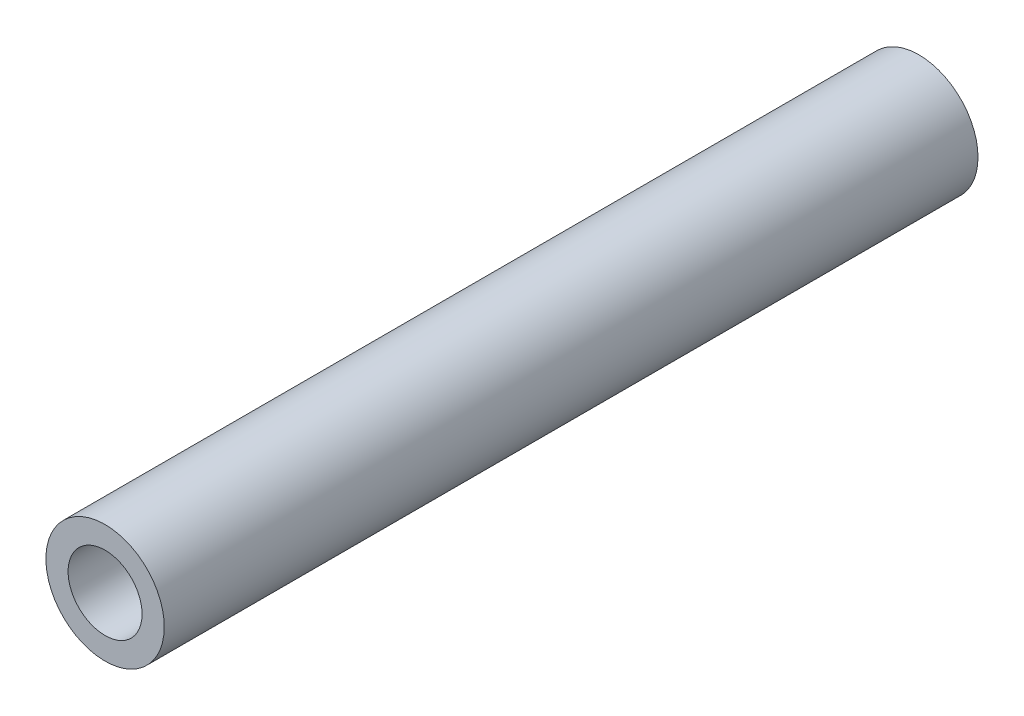
ISO-10303-21;
HEADER;
FILE_DESCRIPTION(('STEP AP214'),'2;1');
FILE_NAME('part.step','',(''),(''),'','','');
FILE_SCHEMA(('AUTOMOTIVE_DESIGN { 1 0 10303 214 1 1 1 1 }'));
ENDSEC;
DATA;
#1=APPLICATION_CONTEXT('core data for automotive mechanical design processes');
#2=APPLICATION_PROTOCOL_DEFINITION('international standard','automotive_design',2000,#1);
#3=PRODUCT_CONTEXT('',#1,'mechanical');
#4=PRODUCT('Part','Part','',(#3));
#5=PRODUCT_RELATED_PRODUCT_CATEGORY('part','',(#4));
#6=PRODUCT_DEFINITION_FORMATION('','',#4);
#7=PRODUCT_DEFINITION_CONTEXT('part definition',#1,'design');
#8=PRODUCT_DEFINITION('design','',#6,#7);
#9=PRODUCT_DEFINITION_SHAPE('','',#8);
#10=(LENGTH_UNIT() NAMED_UNIT(*) SI_UNIT(.MILLI.,.METRE.));
#11=(NAMED_UNIT(*) PLANE_ANGLE_UNIT() SI_UNIT($,.RADIAN.));
#12=(NAMED_UNIT(*) SI_UNIT($,.STERADIAN.) SOLID_ANGLE_UNIT());
#13=UNCERTAINTY_MEASURE_WITH_UNIT(LENGTH_MEASURE(1.E-05),#10,'distance_accuracy_value','');
#14=(GEOMETRIC_REPRESENTATION_CONTEXT(3) GLOBAL_UNCERTAINTY_ASSIGNED_CONTEXT((#13)) GLOBAL_UNIT_ASSIGNED_CONTEXT((#10,
#11,#12)) REPRESENTATION_CONTEXT('',''));
#15=CARTESIAN_POINT('',(0.,0.,0.));
#16=DIRECTION('',(0.,0.,1.));
#17=DIRECTION('',(1.,0.,0.));
#18=AXIS2_PLACEMENT_3D('',#15,#16,#17);
#19=CARTESIAN_POINT('',(0.,0.,22.));
#20=DIRECTION('',(0.,0.,1.));
#21=DIRECTION('',(1.,0.,0.));
#22=AXIS2_PLACEMENT_3D('',#19,#20,#21);
#23=PLANE('',#22);
#24=CARTESIAN_POINT('',(0.,0.,22.));
#25=DIRECTION('',(0.,0.,1.));
#26=DIRECTION('',(1.,0.,0.));
#27=AXIS2_PLACEMENT_3D('',#24,#25,#26);
#28=CIRCLE('',#27,1.6);
#29=CARTESIAN_POINT('',(1.6,0.,22.));
#30=VERTEX_POINT('',#29);
#31=EDGE_CURVE('E10',#30,#30,#28,.T.);
#32=ORIENTED_EDGE('',*,*,#31,.T.);
#33=EDGE_LOOP('',(#32));
#34=FACE_BOUND('',#33,.T.);
#35=CARTESIAN_POINT('',(0.,0.,22.));
#36=DIRECTION('',(0.,0.,1.));
#37=DIRECTION('',(1.,0.,0.));
#38=AXIS2_PLACEMENT_3D('',#35,#36,#37);
#39=CIRCLE('',#38,1.);
#40=CARTESIAN_POINT('',(1.,0.,22.));
#41=VERTEX_POINT('',#40);
#42=EDGE_CURVE('E51',#41,#41,#39,.T.);
#43=ORIENTED_EDGE('',*,*,#42,.F.);
#44=EDGE_LOOP('',(#43));
#45=FACE_BOUND('',#44,.T.);
#46=ADVANCED_FACE('F35',(#34,#45),#23,.T.);
#47=CARTESIAN_POINT('',(0.,0.,0.));
#48=DIRECTION('',(0.,0.,1.));
#49=DIRECTION('',(1.,0.,0.));
#50=AXIS2_PLACEMENT_3D('',#47,#48,#49);
#51=PLANE('',#50);
#52=CARTESIAN_POINT('',(0.,0.,0.));
#53=DIRECTION('',(0.,0.,1.));
#54=DIRECTION('',(1.,0.,0.));
#55=AXIS2_PLACEMENT_3D('',#52,#53,#54);
#56=CIRCLE('',#55,1.6);
#57=CARTESIAN_POINT('',(1.6,0.,0.));
#58=VERTEX_POINT('',#57);
#59=EDGE_CURVE('E39',#58,#58,#56,.T.);
#60=ORIENTED_EDGE('',*,*,#59,.F.);
#61=EDGE_LOOP('',(#60));
#62=FACE_BOUND('',#61,.T.);
#63=CARTESIAN_POINT('',(0.,0.,0.));
#64=DIRECTION('',(0.,0.,1.));
#65=DIRECTION('',(1.,0.,0.));
#66=AXIS2_PLACEMENT_3D('',#63,#64,#65);
#67=CIRCLE('',#66,1.);
#68=CARTESIAN_POINT('',(1.,0.,0.));
#69=VERTEX_POINT('',#68);
#70=EDGE_CURVE('E53',#69,#69,#67,.T.);
#71=ORIENTED_EDGE('',*,*,#70,.T.);
#72=EDGE_LOOP('',(#71));
#73=FACE_BOUND('',#72,.T.);
#74=ADVANCED_FACE('F64',(#62,#73),#51,.F.);
#75=CARTESIAN_POINT('',(0.,0.,22.));
#76=DIRECTION('',(0.,0.,-1.));
#77=DIRECTION('',(-1.,0.,0.));
#78=AXIS2_PLACEMENT_3D('',#75,#76,#77);
#79=CYLINDRICAL_SURFACE('',#78,1.6);
#80=ORIENTED_EDGE('',*,*,#31,.F.);
#81=EDGE_LOOP('',(#80));
#82=FACE_BOUND('',#81,.T.);
#83=ORIENTED_EDGE('',*,*,#59,.T.);
#84=EDGE_LOOP('',(#83));
#85=FACE_BOUND('',#84,.T.);
#86=ADVANCED_FACE('F37',(#82,#85),#79,.T.);
#87=CARTESIAN_POINT('',(0.,0.,22.));
#88=DIRECTION('',(0.,0.,-1.));
#89=DIRECTION('',(-1.,0.,0.));
#90=AXIS2_PLACEMENT_3D('',#87,#88,#89);
#91=CYLINDRICAL_SURFACE('',#90,1.);
#92=ORIENTED_EDGE('',*,*,#42,.T.);
#93=EDGE_LOOP('',(#92));
#94=FACE_BOUND('',#93,.T.);
#95=ORIENTED_EDGE('',*,*,#70,.F.);
#96=EDGE_LOOP('',(#95));
#97=FACE_BOUND('',#96,.T.);
#98=ADVANCED_FACE('F60',(#94,#97),#91,.F.);
#99=CLOSED_SHELL('',(#46,#74,#86,#98));
#100=MANIFOLD_SOLID_BREP('B2',#99);
#101=ADVANCED_BREP_SHAPE_REPRESENTATION('',(#18,#100),#14);
#102=SHAPE_DEFINITION_REPRESENTATION(#9,#101);
ENDSEC;
END-ISO-10303-21;
